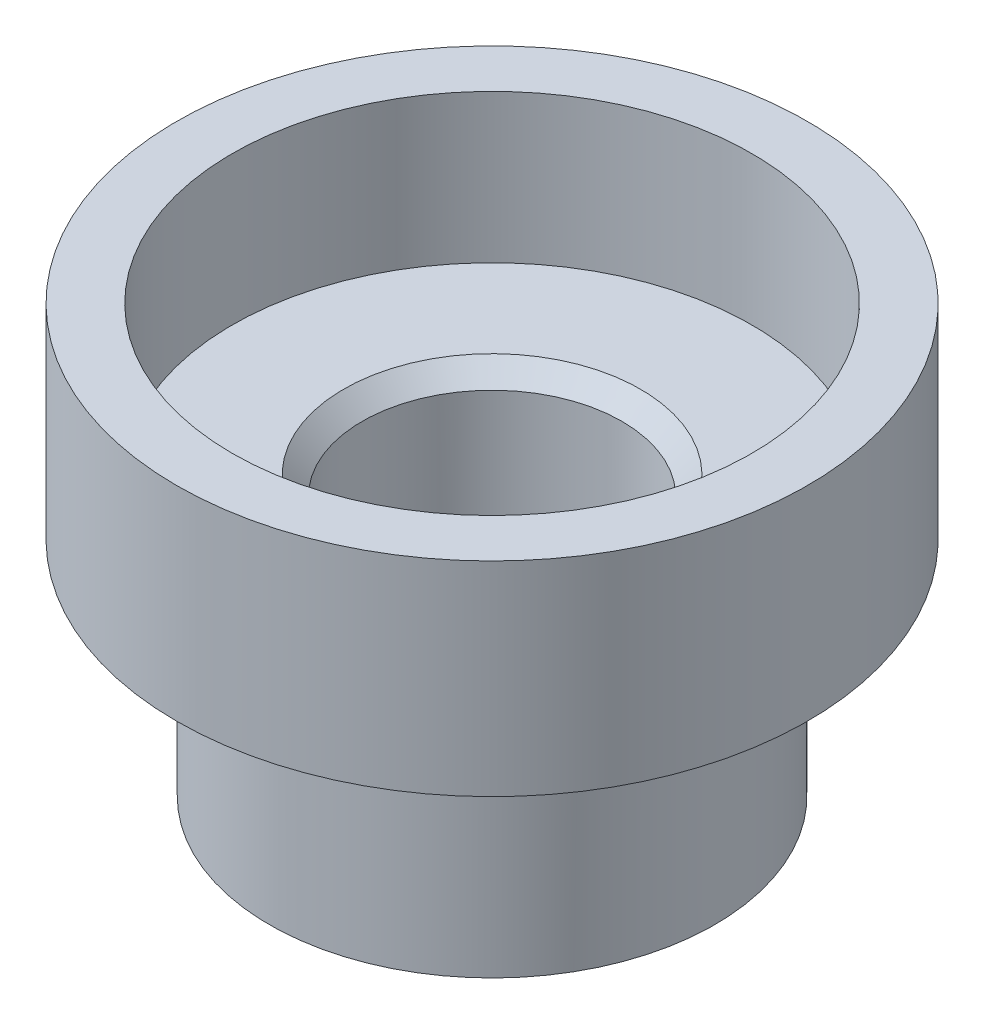
ISO-10303-21;
HEADER;
FILE_DESCRIPTION(('STEP AP214'),'2;1');
FILE_NAME('part.step','',(''),(''),'','','');
FILE_SCHEMA(('AUTOMOTIVE_DESIGN { 1 0 10303 214 1 1 1 1 }'));
ENDSEC;
DATA;
#1=APPLICATION_CONTEXT('core data for automotive mechanical design processes');
#2=APPLICATION_PROTOCOL_DEFINITION('international standard','automotive_design',2000,#1);
#3=PRODUCT_CONTEXT('',#1,'mechanical');
#4=PRODUCT('Part','Part','',(#3));
#5=PRODUCT_RELATED_PRODUCT_CATEGORY('part','',(#4));
#6=PRODUCT_DEFINITION_FORMATION('','',#4);
#7=PRODUCT_DEFINITION_CONTEXT('part definition',#1,'design');
#8=PRODUCT_DEFINITION('design','',#6,#7);
#9=PRODUCT_DEFINITION_SHAPE('','',#8);
#10=(LENGTH_UNIT() NAMED_UNIT(*) SI_UNIT(.MILLI.,.METRE.));
#11=(NAMED_UNIT(*) PLANE_ANGLE_UNIT() SI_UNIT($,.RADIAN.));
#12=(NAMED_UNIT(*) SI_UNIT($,.STERADIAN.) SOLID_ANGLE_UNIT());
#13=UNCERTAINTY_MEASURE_WITH_UNIT(LENGTH_MEASURE(1.E-05),#10,'distance_accuracy_value','');
#14=(GEOMETRIC_REPRESENTATION_CONTEXT(3) GLOBAL_UNCERTAINTY_ASSIGNED_CONTEXT((#13)) GLOBAL_UNIT_ASSIGNED_CONTEXT((#10,
#11,#12)) REPRESENTATION_CONTEXT('',''));
#15=CARTESIAN_POINT('',(0.,0.,0.));
#16=DIRECTION('',(0.,0.,1.));
#17=DIRECTION('',(1.,0.,0.));
#18=AXIS2_PLACEMENT_3D('',#15,#16,#17);
#19=CARTESIAN_POINT('',(0.,0.,0.));
#20=DIRECTION('',(0.,1.,0.));
#21=DIRECTION('',(0.,0.,1.));
#22=AXIS2_PLACEMENT_3D('',#19,#20,#21);
#23=CYLINDRICAL_SURFACE('',#22,1.4);
#24=CARTESIAN_POINT('',(0.,-4.6,0.));
#25=DIRECTION('',(0.,1.,0.));
#26=DIRECTION('',(0.,0.,1.));
#27=AXIS2_PLACEMENT_3D('',#24,#25,#26);
#28=CIRCLE('',#27,1.4);
#29=CARTESIAN_POINT('',(0.,-4.6,1.4));
#30=VERTEX_POINT('',#29);
#31=EDGE_CURVE('E90',#30,#30,#28,.F.);
#32=ORIENTED_EDGE('',*,*,#31,.T.);
#33=EDGE_LOOP('',(#32));
#34=FACE_BOUND('',#33,.T.);
#35=CARTESIAN_POINT('',(0.,-1.79999999994607,0.));
#36=DIRECTION('',(0.,1.,0.));
#37=DIRECTION('',(0.,0.,-1.));
#38=AXIS2_PLACEMENT_3D('',#35,#36,#37);
#39=CIRCLE('',#38,1.39999999998963);
#40=CARTESIAN_POINT('',(0.,-1.79999999994607,-1.39999999998963));
#41=VERTEX_POINT('',#40);
#42=EDGE_CURVE('E88',#41,#41,#39,.T.);
#43=ORIENTED_EDGE('',*,*,#42,.T.);
#44=EDGE_LOOP('',(#43));
#45=FACE_BOUND('',#44,.T.);
#46=ADVANCED_FACE('F16',(#34,#45),#23,.F.);
#47=CARTESIAN_POINT('',(0.,-1.59999999999627,0.));
#48=DIRECTION('',(0.,1.,0.));
#49=DIRECTION('',(0.,0.,1.));
#50=AXIS2_PLACEMENT_3D('',#47,#48,#49);
#51=CONICAL_SURFACE('',#50,1.59999999993943,0.785398163397448);
#52=CARTESIAN_POINT('',(0.,-1.59999999993943,0.));
#53=DIRECTION('',(0.,1.,0.));
#54=DIRECTION('',(0.,0.,1.));
#55=AXIS2_PLACEMENT_3D('',#52,#53,#54);
#56=CIRCLE('',#55,1.59999999999627);
#57=CARTESIAN_POINT('',(0.,-1.59999999993943,1.59999999999627));
#58=VERTEX_POINT('',#57);
#59=EDGE_CURVE('E101',#58,#58,#56,.F.);
#60=ORIENTED_EDGE('',*,*,#59,.F.);
#61=EDGE_LOOP('',(#60));
#62=FACE_BOUND('',#61,.T.);
#63=ORIENTED_EDGE('',*,*,#42,.F.);
#64=EDGE_LOOP('',(#63));
#65=FACE_BOUND('',#64,.T.);
#66=ADVANCED_FACE('F112',(#62,#65),#51,.F.);
#67=CARTESIAN_POINT('',(0.,-4.6,0.));
#68=DIRECTION('',(0.,1.,0.));
#69=DIRECTION('',(0.,0.,1.));
#70=AXIS2_PLACEMENT_3D('',#67,#68,#69);
#71=PLANE('',#70);
#72=ORIENTED_EDGE('',*,*,#31,.F.);
#73=EDGE_LOOP('',(#72));
#74=FACE_BOUND('',#73,.T.);
#75=CARTESIAN_POINT('',(0.,-4.6,0.));
#76=DIRECTION('',(0.,-1.,0.));
#77=DIRECTION('',(0.,0.,-1.));
#78=AXIS2_PLACEMENT_3D('',#75,#76,#77);
#79=CIRCLE('',#78,2.4);
#80=CARTESIAN_POINT('',(0.,-4.6,-2.4));
#81=VERTEX_POINT('',#80);
#82=EDGE_CURVE('E98',#81,#81,#79,.F.);
#83=ORIENTED_EDGE('',*,*,#82,.F.);
#84=EDGE_LOOP('',(#83));
#85=FACE_BOUND('',#84,.T.);
#86=ADVANCED_FACE('F108',(#74,#85),#71,.F.);
#87=CARTESIAN_POINT('',(0.,-1.6,0.));
#88=DIRECTION('',(0.,1.,0.));
#89=DIRECTION('',(0.,0.,1.));
#90=AXIS2_PLACEMENT_3D('',#87,#88,#89);
#91=PLANE('',#90);
#92=ORIENTED_EDGE('',*,*,#59,.T.);
#93=EDGE_LOOP('',(#92));
#94=FACE_BOUND('',#93,.T.);
#95=CARTESIAN_POINT('',(0.,-1.6,0.));
#96=DIRECTION('',(0.,1.,0.));
#97=DIRECTION('',(0.,0.,1.));
#98=AXIS2_PLACEMENT_3D('',#95,#96,#97);
#99=CIRCLE('',#98,2.8);
#100=CARTESIAN_POINT('',(0.,-1.6,2.8));
#101=VERTEX_POINT('',#100);
#102=EDGE_CURVE('E87',#101,#101,#99,.T.);
#103=ORIENTED_EDGE('',*,*,#102,.T.);
#104=EDGE_LOOP('',(#103));
#105=FACE_BOUND('',#104,.T.);
#106=ADVANCED_FACE('F111',(#94,#105),#91,.T.);
#107=CARTESIAN_POINT('',(0.,-2.08,0.));
#108=DIRECTION('',(0.,-1.,0.));
#109=DIRECTION('',(0.,0.,-1.));
#110=AXIS2_PLACEMENT_3D('',#107,#108,#109);
#111=CYLINDRICAL_SURFACE('',#110,2.4);
#112=ORIENTED_EDGE('',*,*,#82,.T.);
#113=EDGE_LOOP('',(#112));
#114=FACE_BOUND('',#113,.T.);
#115=CARTESIAN_POINT('',(0.,-2.4,0.));
#116=DIRECTION('',(0.,-1.,0.));
#117=DIRECTION('',(0.999978425521982,0.,0.00656875106682888));
#118=AXIS2_PLACEMENT_3D('',#115,#116,#117);
#119=CIRCLE('',#118,2.4);
#120=CARTESIAN_POINT('',(2.39994822125276,-2.4,0.0157650025603893));
#121=VERTEX_POINT('',#120);
#122=EDGE_CURVE('E79',#121,#121,#119,.T.);
#123=ORIENTED_EDGE('',*,*,#122,.T.);
#124=EDGE_LOOP('',(#123));
#125=FACE_BOUND('',#124,.T.);
#126=ADVANCED_FACE('F116',(#114,#125),#111,.T.);
#127=CARTESIAN_POINT('',(0.,0.,0.));
#128=DIRECTION('',(0.,1.,0.));
#129=DIRECTION('',(0.,0.,1.));
#130=AXIS2_PLACEMENT_3D('',#127,#128,#129);
#131=CYLINDRICAL_SURFACE('',#130,2.8);
#132=ORIENTED_EDGE('',*,*,#102,.F.);
#133=EDGE_LOOP('',(#132));
#134=FACE_BOUND('',#133,.T.);
#135=CARTESIAN_POINT('',(0.,0.,0.));
#136=DIRECTION('',(0.,1.,0.));
#137=DIRECTION('',(0.,0.,1.));
#138=AXIS2_PLACEMENT_3D('',#135,#136,#137);
#139=CIRCLE('',#138,2.8);
#140=CARTESIAN_POINT('',(0.,0.,2.8));
#141=VERTEX_POINT('',#140);
#142=EDGE_CURVE('E41',#141,#141,#139,.F.);
#143=ORIENTED_EDGE('',*,*,#142,.F.);
#144=EDGE_LOOP('',(#143));
#145=FACE_BOUND('',#144,.T.);
#146=ADVANCED_FACE('F72',(#134,#145),#131,.F.);
#147=CARTESIAN_POINT('',(0.,-2.4,0.));
#148=DIRECTION('',(0.,-1.,0.));
#149=DIRECTION('',(0.999978425521982,0.,0.00656875106682888));
#150=AXIS2_PLACEMENT_3D('',#147,#148,#149);
#151=TOROIDAL_SURFACE('',#150,2.6,0.2);
#152=CARTESIAN_POINT('',(0.,-2.2,0.));
#153=DIRECTION('',(0.,-1.,0.));
#154=DIRECTION('',(-1.,0.,0.));
#155=AXIS2_PLACEMENT_3D('',#152,#153,#154);
#156=CIRCLE('',#155,2.6);
#157=CARTESIAN_POINT('',(2.6,-2.2,0.));
#158=VERTEX_POINT('',#157);
#159=CARTESIAN_POINT('',(-2.6,-2.2,0.));
#160=VERTEX_POINT('',#159);
#161=EDGE_CURVE('E33',#158,#160,#156,.F.);
#162=ORIENTED_EDGE('',*,*,#161,.F.);
#163=CARTESIAN_POINT('',(2.6,-2.2,0.));
#164=CARTESIAN_POINT('',(2.60000049920992,-2.19999999999139,0.0056928883836762));
#165=CARTESIAN_POINT('',(2.59998246540807,-2.19999999999483,0.0113858551680357));
#166=CARTESIAN_POINT('',(2.59974849726799,-2.20000000008924,0.0477789546559938));
#167=CARTESIAN_POINT('',(2.59901122190446,-2.20000000049821,0.0784775062482753));
#168=CARTESIAN_POINT('',(2.59620687520372,-2.20000000186266,0.145566160742074));
#169=CARTESIAN_POINT('',(2.59391688959473,-2.20000000290605,0.181946953105996));
#170=CARTESIAN_POINT('',(2.58758655164244,-2.20000000537667,0.257229030238127));
#171=CARTESIAN_POINT('',(2.58343072841022,-2.20000000682634,0.29612063962772));
#172=CARTESIAN_POINT('',(2.57302595143077,-2.20000000995503,0.376312746587248));
#173=CARTESIAN_POINT('',(2.56665392958692,-2.20000001164292,0.417597304666159));
#174=CARTESIAN_POINT('',(2.55145914789221,-2.20000001510365,0.502428173414846));
#175=CARTESIAN_POINT('',(2.54250622952022,-2.20000001687504,0.545951216491432));
#176=CARTESIAN_POINT('',(2.521779717035,-2.20000002037768,0.635069676759465));
#177=CARTESIAN_POINT('',(2.50986940992886,-2.20000002210017,0.680633287592458));
#178=CARTESIAN_POINT('',(2.48284872490839,-2.20000002539739,0.773601891502925));
#179=CARTESIAN_POINT('',(2.46759565669384,-2.20000002695829,0.820965637994777));
#180=CARTESIAN_POINT('',(2.44236676382686,-2.20000002909435,0.892230338547363));
#181=CARTESIAN_POINT('',(2.43337128319695,-2.20000002978309,0.91648290745991));
#182=CARTESIAN_POINT('',(2.4144198621738,-2.20000003109046,0.965329130709146));
#183=CARTESIAN_POINT('',(2.40444518372355,-2.20000003170683,0.98991554023767));
#184=CARTESIAN_POINT('',(2.38348870400012,-2.20000003286105,1.03938316888263));
#185=CARTESIAN_POINT('',(2.37248793469863,-2.20000003339653,1.06425634727739));
#186=CARTESIAN_POINT('',(2.34943302342192,-2.20000003438198,1.11424880131724));
#187=CARTESIAN_POINT('',(2.33735971041643,-2.20000003482955,1.13935923917053));
#188=CARTESIAN_POINT('',(2.31211462640453,-2.20000003563338,1.1897732394156));
#189=CARTESIAN_POINT('',(2.29892352368212,-2.20000003598721,1.21506712239832));
#190=CARTESIAN_POINT('',(2.27139909535386,-2.20000003659909,1.26579115637098));
#191=CARTESIAN_POINT('',(2.25704631935049,-2.20000003685471,1.29121075471471));
#192=CARTESIAN_POINT('',(2.22715644500432,-2.20000003726691,1.34212526192931));
#193=CARTESIAN_POINT('',(2.21159982361408,-2.20000003742109,1.36760871123694));
#194=CARTESIAN_POINT('',(2.17926214015292,-2.20000003762844,1.41858583095655));
#195=CARTESIAN_POINT('',(2.16246153134293,-2.20000003767928,1.44406710352102));
#196=CARTESIAN_POINT('',(2.12759808256162,-2.2000000376792,1.49497058946909));
#197=CARTESIAN_POINT('',(2.10951572440166,-2.20000003762605,1.52037943680667));
#198=CARTESIAN_POINT('',(2.07205367478976,-2.20000003741854,1.57106457652729));
#199=CARTESIAN_POINT('',(2.05265454916798,-2.20000003726206,1.59632650678065));
#200=CARTESIAN_POINT('',(2.01252692909229,-2.20000003684972,1.64664009634932));
#201=CARTESIAN_POINT('',(1.99177914321527,-2.20000003659185,1.67167637179899));
#202=CARTESIAN_POINT('',(1.94892562750246,-2.20000003597982,1.72145673769549));
#203=CARTESIAN_POINT('',(1.92680081096262,-2.2000000356238,1.74618439944195));
#204=CARTESIAN_POINT('',(1.88116852787742,-2.20000003481983,1.79526147586282));
#205=CARTESIAN_POINT('',(1.85764224453558,-2.20000003437019,1.81959339676088));
#206=CARTESIAN_POINT('',(1.80918661295156,-2.2000000333846,1.86778886220142));
#207=CARTESIAN_POINT('',(1.78423878617192,-2.20000003284713,1.8916338308304));
#208=CARTESIAN_POINT('',(1.73292437787924,-2.20000003169282,1.93876130906778));
#209=CARTESIAN_POINT('',(1.70653972752502,-2.20000003107464,1.96202414707447));
#210=CARTESIAN_POINT('',(1.65234115118563,-2.20000002976709,2.00788947734709));
#211=CARTESIAN_POINT('',(1.62450964047459,-2.20000002907659,2.03047119262104));
#212=CARTESIAN_POINT('',(1.56741244314659,-2.20000002763386,2.07487277386282));
#213=CARTESIAN_POINT('',(1.53812973318766,-2.20000002688072,2.09667075194067));
#214=CARTESIAN_POINT('',(1.47813131476025,-2.20000002532345,2.1393999658222));
#215=CARTESIAN_POINT('',(1.44739922428931,-2.20000002451864,2.16030820187491));
#216=CARTESIAN_POINT('',(1.38450975955293,-2.20000002287004,2.20114991927836));
#217=CARTESIAN_POINT('',(1.35233672707269,-2.20000002202582,2.22105929295213));
#218=CARTESIAN_POINT('',(1.28658008951852,-2.20000002031171,2.2597924683124));
#219=CARTESIAN_POINT('',(1.25298163473007,-2.20000001944162,2.27859106358275));
#220=CARTESIAN_POINT('',(1.18439631550461,-2.20000001769037,2.31498942127966));
#221=CARTESIAN_POINT('',(1.14939549656672,-2.20000001680926,2.33256289334157));
#222=CARTESIAN_POINT('',(1.07803551139999,-2.20000001505183,2.36639570998398));
#223=CARTESIAN_POINT('',(1.04166337429884,-2.20000001417583,2.38262770099289));
#224=CARTESIAN_POINT('',(0.967599150323217,-2.20000001244575,2.4136606871214));
#225=CARTESIAN_POINT('',(0.929895165979824,-2.20000001159227,2.42843329249567));
#226=CARTESIAN_POINT('',(0.853214400551235,-2.20000000992567,2.45642957644609));
#227=CARTESIAN_POINT('',(0.81422688617035,-2.20000000911343,2.46962386275218));
#228=CARTESIAN_POINT('',(0.73503536579722,-2.200000007549,2.4943450800528));
#229=CARTESIAN_POINT('',(0.694821881982604,-2.20000000679799,2.50584165684822));
#230=CARTESIAN_POINT('',(0.613244261564996,-2.20000000537702,2.52704914333833));
#231=CARTESIAN_POINT('',(0.571871994162301,-2.20000000470854,2.53672878467978));
#232=CARTESIAN_POINT('',(0.488052487336266,-2.20000000347487,2.55418488816612));
#233=CARTESIAN_POINT('',(0.445598554767478,-2.20000000291146,2.56192922326882));
#234=CARTESIAN_POINT('',(0.359701671925129,-2.20000000191159,2.57539868134831));
#235=CARTESIAN_POINT('',(0.316253557843378,-2.20000000147721,2.58109088110243));
#236=CARTESIAN_POINT('',(0.226355151113188,-2.20000000074271,2.59056473764533));
#237=CARTESIAN_POINT('',(0.179889607501885,-2.20000000045288,2.59420192003577));
#238=CARTESIAN_POINT('',(0.0861005004535176,-2.20000000007049,2.59901120711426));
#239=CARTESIAN_POINT('',(0.0387748811834802,-2.19999999998109,2.60014387835258));
#240=CARTESIAN_POINT('',(-0.036852094016822,-2.20000000001722,2.59988954663493));
#241=CARTESIAN_POINT('',(-0.065158862310671,-2.20000000007083,2.59933192870838));
#242=CARTESIAN_POINT('',(-0.121739777536009,-2.20000000021689,2.59729304454361));
#243=CARTESIAN_POINT('',(-0.150013924539717,-2.20000000030934,2.59581178035418));
#244=CARTESIAN_POINT('',(-0.207901826460404,-2.2000000005072,2.59183050601967));
#245=CARTESIAN_POINT('',(-0.237512352777621,-2.20000000061304,2.58928354236668));
#246=CARTESIAN_POINT('',(-0.296628701811249,-2.20000000080599,2.5831765035699));
#247=CARTESIAN_POINT('',(-0.326134524666092,-2.20000000089311,2.57961642976605));
#248=CARTESIAN_POINT('',(-0.38500683233313,-2.20000000103022,2.57148733767954));
#249=CARTESIAN_POINT('',(-0.414373317257828,-2.2000000010802,2.56691832021165));
#250=CARTESIAN_POINT('',(-0.472932473188287,-2.20000000113336,2.55677671255904));
#251=CARTESIAN_POINT('',(-0.502125144244883,-2.20000000113652,2.55120412266785));
#252=CARTESIAN_POINT('',(-0.560302401608624,-2.20000000109585,2.53906190266789));
#253=CARTESIAN_POINT('',(-0.589286987869451,-2.200000001052,2.53249227233718));
#254=CARTESIAN_POINT('',(-0.647014049385745,-2.20000000092418,2.5183637175657));
#255=CARTESIAN_POINT('',(-0.675756524462602,-2.20000000084021,2.51080479239517));
#256=CARTESIAN_POINT('',(-0.732965618257738,-2.20000000065497,2.49470639418598));
#257=CARTESIAN_POINT('',(-0.761432236630401,-2.20000000055369,2.48616691991898));
#258=CARTESIAN_POINT('',(-0.818056206934506,-2.20000000033957,2.46811791670246));
#259=CARTESIAN_POINT('',(-0.84621355831914,-2.20000000022672,2.45860838603812));
#260=CARTESIAN_POINT('',(-0.904172686957064,-2.20000000009696,2.43791947796357));
#261=CARTESIAN_POINT('',(-0.933949291400278,-2.20000000008744,2.42666948090111));
#262=CARTESIAN_POINT('',(-0.991289437013461,-2.19999999992247,2.40380012017548));
#263=CARTESIAN_POINT('',(-1.01887819891595,-2.19999999977585,2.3922438808916));
#264=CARTESIAN_POINT('',(-1.07573695154257,-2.20000000268177,2.36727850174959));
#265=CARTESIAN_POINT('',(-1.1049744447917,-2.20000000597945,2.3537952567429));
#266=CARTESIAN_POINT('',(-1.16293250054748,-2.20000002613954,2.32576297065909));
#267=CARTESIAN_POINT('',(-1.19165308245104,-2.20000004300145,2.31121396967839));
#268=CARTESIAN_POINT('',(-1.24853935838284,-2.20000010827893,2.28107075378478));
#269=CARTESIAN_POINT('',(-1.27670506565022,-2.20000015669375,2.26547656384891));
#270=CARTESIAN_POINT('',(-1.33244372839289,-2.20000030254824,2.23326178019695));
#271=CARTESIAN_POINT('',(-1.36001668989694,-2.20000039998741,2.21664119692686));
#272=CARTESIAN_POINT('',(-1.40251763391783,-2.2000006283131,2.18994990871875));
#273=CARTESIAN_POINT('',(-1.41766183196156,-2.20000072552175,2.18022156893506));
#274=CARTESIAN_POINT('',(-1.4520834083059,-2.20000095590739,2.15759506528938));
#275=CARTESIAN_POINT('',(-1.47129232192555,-2.20000109136861,2.14459233184278));
#276=CARTESIAN_POINT('',(-1.5093395465715,-2.20000129822682,2.11806117818942));
#277=CARTESIAN_POINT('',(-1.52817790202573,-2.20000136963154,2.10453282158787));
#278=CARTESIAN_POINT('',(-1.57270842085949,-2.20000145474458,2.07161626828655));
#279=CARTESIAN_POINT('',(-1.5982253837909,-2.20000143533935,2.05199015661557));
#280=CARTESIAN_POINT('',(-1.64847844464334,-2.20000126329793,2.01177624248936));
#281=CARTESIAN_POINT('',(-1.67321472785214,-2.20000111069361,1.9911886711491));
#282=CARTESIAN_POINT('',(-1.7224663671317,-2.20000073186249,1.94860578048942));
#283=CARTESIAN_POINT('',(-1.74696304726462,-2.20000050399833,1.92658880518035));
#284=CARTESIAN_POINT('',(-1.79500594764417,-2.20000015155488,1.88155874642232));
#285=CARTESIAN_POINT('',(-1.81855247996834,-2.20000002694141,1.85854599526955));
#286=CARTESIAN_POINT('',(-1.85201843433337,-2.19999998808252,1.82486343692104));
#287=CARTESIAN_POINT('',(-1.86221567107484,-2.19999999528252,1.81446588377364));
#288=CARTESIAN_POINT('',(-1.89550890177156,-2.20000001096179,1.77996282880782));
#289=CARTESIAN_POINT('',(-1.91824447461193,-2.20000000907034,1.75550657277056));
#290=CARTESIAN_POINT('',(-1.9677554085096,-2.20000006546473,1.7001580943607));
#291=CARTESIAN_POINT('',(-1.99429276606134,-2.20000013734636,1.66905290464752));
#292=CARTESIAN_POINT('',(-2.04706164575992,-2.20000034052233,1.60415474324957));
#293=CARTESIAN_POINT('',(-2.07322228930638,-2.20000047441013,1.57030399544555));
#294=CARTESIAN_POINT('',(-2.11261951565046,-2.20000065326346,1.51659830038287));
#295=CARTESIAN_POINT('',(-2.12645263221592,-2.20000071136118,1.49717831447742));
#296=CARTESIAN_POINT('',(-2.1520981744878,-2.20000078786894,1.46008403738455));
#297=CARTESIAN_POINT('',(-2.16396707274762,-2.20000080989908,1.44244876771365));
#298=CARTESIAN_POINT('',(-2.19733433179763,-2.20000083609122,1.39151019245463));
#299=CARTESIAN_POINT('',(-2.21828429571028,-2.20000080832775,1.35784547733481));
#300=CARTESIAN_POINT('',(-2.25860515203814,-2.20000070694899,1.28958961539813));
#301=CARTESIAN_POINT('',(-2.27797622590722,-2.20000063333897,1.25499857564786));
#302=CARTESIAN_POINT('',(-2.31159700194631,-2.20000047298059,1.19156209789266));
#303=CARTESIAN_POINT('',(-2.32612367002117,-2.20000039132649,1.16286309531945));
#304=CARTESIAN_POINT('',(-2.35409018104195,-2.20000023345619,1.10494453241244));
#305=CARTESIAN_POINT('',(-2.3675301628153,-2.20000015723929,1.07572503915677));
#306=CARTESIAN_POINT('',(-2.3936014014656,-2.20000004030497,1.01610689776663));
#307=CARTESIAN_POINT('',(-2.40620620974152,-2.20000000046445,0.985696678839684));
#308=CARTESIAN_POINT('',(-2.4288367994848,-2.19999999959132,0.928055645714877));
#309=CARTESIAN_POINT('',(-2.43899119016448,-2.20000002977847,0.90087515513247));
#310=CARTESIAN_POINT('',(-2.45865381059271,-2.20000008084605,0.845543980574874));
#311=CARTESIAN_POINT('',(-2.46814063198186,-2.20000010148522,0.817385683186435));
#312=CARTESIAN_POINT('',(-2.48617116017715,-2.20000010319827,0.760773499109948));
#313=CARTESIAN_POINT('',(-2.49471500939209,-2.20000008427812,0.732319657767393));
#314=CARTESIAN_POINT('',(-2.51085741777194,-2.20000003993552,0.675148410552356));
#315=CARTESIAN_POINT('',(-2.51845608276173,-2.20000001451379,0.646431034573074));
#316=CARTESIAN_POINT('',(-2.53268336324213,-2.19999998649454,0.588759242913079));
#317=CARTESIAN_POINT('',(-2.53931204940885,-2.19999998389536,0.559804844665148));
#318=CARTESIAN_POINT('',(-2.54864202887309,-2.20000020460551,0.515884816666666));
#319=CARTESIAN_POINT('',(-2.55168088833789,-2.20000031825361,0.500990339957168));
#320=CARTESIAN_POINT('',(-2.55986759466819,-2.2000004949118,0.458528551453289));
#321=CARTESIAN_POINT('',(-2.56462800174802,-2.20000043400824,0.430886535562688));
#322=CARTESIAN_POINT('',(-2.57711373919438,-2.20000027399825,0.350722257943054));
#323=CARTESIAN_POINT('',(-2.58369242412868,-2.20000018932043,0.298016809680987));
#324=CARTESIAN_POINT('',(-2.59146885405815,-2.20000008779285,0.214941669001089));
#325=CARTESIAN_POINT('',(-2.59376450136401,-2.20000005742487,0.184669803898485));
#326=CARTESIAN_POINT('',(-2.59853036395245,-2.19999999749993,0.102974880224405));
#327=CARTESIAN_POINT('',(-2.60001028262786,-2.19999998321459,0.0514930136698055));
#328=CARTESIAN_POINT('',(-2.6,-2.2,0.));
#329=B_SPLINE_CURVE_WITH_KNOTS('',3,(#163,#164,#165,#166,#167,#168,#169,#170,#171,#172,#173,
#174,#175,#176,#177,#178,#179,#180,#181,#182,#183,#184,#185,#186,#187,#188,#189,#190,#191,#192,
#193,#194,#195,#196,#197,#198,#199,#200,#201,#202,#203,#204,#205,#206,#207,#208,#209,#210,#211,
#212,#213,#214,#215,#216,#217,#218,#219,#220,#221,#222,#223,#224,#225,#226,#227,#228,#229,#230,
#231,#232,#233,#234,#235,#236,#237,#238,#239,#240,#241,#242,#243,#244,#245,#246,#247,#248,#249,
#250,#251,#252,#253,#254,#255,#256,#257,#258,#259,#260,#261,#262,#263,#264,#265,#266,#267,#268,
#269,#270,#271,#272,#273,#274,#275,#276,#277,#278,#279,#280,#281,#282,#283,#284,#285,#286,#287,
#288,#289,#290,#291,#292,#293,#294,#295,#296,#297,#298,#299,#300,#301,#302,#303,#304,#305,#306,
#307,#308,#309,#310,#311,#312,#313,#314,#315,#316,#317,#318,#319,#320,#321,#322,#323,#324,#325,
#326,#327,#328),.UNSPECIFIED.,.F.,.F.,(4,2,2,2,2,2,2,2,2,2,2,2,2,2,2,2,2,2,2,2,2,2,2,2,2,2,2,2,
2,2,2,2,2,2,2,2,2,2,2,2,2,2,2,2,2,2,2,2,2,2,2,2,2,2,2,2,2,2,2,2,2,2,2,2,2,2,2,2,2,2,2,2,2,2,2,2,
2,2,2,2,2,2,4),(0.,0.0170788514401823,0.109180065598782,0.218506321988646,0.335805478571176,
0.461077273852262,0.594321408883524,0.735537547267529,0.884725315162214,0.962317069628469,
1.04190225716281,1.12348085558846,1.20705284126717,1.29261818909928,1.38017687252374,
1.46972886351815,1.56127413259881,1.65481264882075,1.75034437977776,1.84786929160242,
1.94738734896614,2.04889851507921,2.15240275169077,2.25790001908891,2.36539027610067,
2.47487348009205,2.58634958696807,2.6998185511728,2.81528032568938,2.93273486204001,
3.05218211028607,3.17362201902808,3.29705453540575,3.42247960509801,3.54989717232304,
3.67930717983832,3.81070956894064,3.95046611466727,4.0924079078375,4.17733141726956,
4.26225473832811,4.35139686684637,4.44053887746382,4.52968081609472,4.6188227286533,
4.70796466105381,4.79710665921048,4.88624876903757,4.97539103644931,5.07086186851326,
5.16057882044586,5.2571469197353,5.35371138775519,5.45027354897983,5.54683472761464,
5.60083060573766,5.67040900119865,5.73997900310269,5.83652850947084,5.93305492561267,
6.03183737289254,6.13058710635135,6.17427690522248,6.27442605410344,6.39704337467051,
6.52533035350631,6.59685102649464,6.66061714337516,6.77952501425693,6.89841920033185,
6.994895577451,7.09135960988557,7.19009197576175,7.27712320383641,7.36624713896513,
7.455357596019,7.54445806707406,7.63355204271495,7.67915345528117,7.76328372959619,
7.92251407127643,8.01357470782754,8.16800593990304),.UNSPECIFIED.);
#330=EDGE_CURVE('E36',#160,#158,#329,.F.);
#331=ORIENTED_EDGE('',*,*,#330,.F.);
#332=EDGE_LOOP('',(#162,#331));
#333=FACE_BOUND('',#332,.T.);
#334=ORIENTED_EDGE('',*,*,#122,.F.);
#335=EDGE_LOOP('',(#334));
#336=FACE_BOUND('',#335,.T.);
#337=ADVANCED_FACE('F37',(#333,#336),#151,.F.);
#338=CARTESIAN_POINT('',(0.,0.,0.));
#339=DIRECTION('',(0.,1.,0.));
#340=DIRECTION('',(0.,0.,1.));
#341=AXIS2_PLACEMENT_3D('',#338,#339,#340);
#342=PLANE('',#341);
#343=ORIENTED_EDGE('',*,*,#142,.T.);
#344=EDGE_LOOP('',(#343));
#345=FACE_BOUND('',#344,.T.);
#346=CARTESIAN_POINT('',(0.,0.,0.));
#347=DIRECTION('',(0.,1.,0.));
#348=DIRECTION('',(0.,0.,1.));
#349=AXIS2_PLACEMENT_3D('',#346,#347,#348);
#350=CIRCLE('',#349,3.4);
#351=CARTESIAN_POINT('',(0.,0.,3.4));
#352=VERTEX_POINT('',#351);
#353=EDGE_CURVE('E26',#352,#352,#350,.F.);
#354=ORIENTED_EDGE('',*,*,#353,.F.);
#355=EDGE_LOOP('',(#354));
#356=FACE_BOUND('',#355,.T.);
#357=ADVANCED_FACE('F65',(#345,#356),#342,.T.);
#358=CARTESIAN_POINT('',(0.,-2.2,0.));
#359=DIRECTION('',(0.,-1.,0.));
#360=DIRECTION('',(0.,0.,-1.));
#361=AXIS2_PLACEMENT_3D('',#358,#359,#360);
#362=PLANE('',#361);
#363=ORIENTED_EDGE('',*,*,#330,.T.);
#364=ORIENTED_EDGE('',*,*,#161,.T.);
#365=EDGE_LOOP('',(#363,#364));
#366=FACE_BOUND('',#365,.T.);
#367=CARTESIAN_POINT('',(0.,-2.2,0.));
#368=DIRECTION('',(0.,1.,0.));
#369=DIRECTION('',(0.,0.,1.));
#370=AXIS2_PLACEMENT_3D('',#367,#368,#369);
#371=CIRCLE('',#370,3.4);
#372=CARTESIAN_POINT('',(0.,-2.2,3.4));
#373=VERTEX_POINT('',#372);
#374=EDGE_CURVE('E11',#373,#373,#371,.T.);
#375=ORIENTED_EDGE('',*,*,#374,.F.);
#376=EDGE_LOOP('',(#375));
#377=FACE_BOUND('',#376,.T.);
#378=ADVANCED_FACE('F44',(#366,#377),#362,.T.);
#379=CARTESIAN_POINT('',(0.,0.,0.));
#380=DIRECTION('',(0.,1.,0.));
#381=DIRECTION('',(0.,0.,1.));
#382=AXIS2_PLACEMENT_3D('',#379,#380,#381);
#383=CYLINDRICAL_SURFACE('',#382,3.4);
#384=ORIENTED_EDGE('',*,*,#353,.T.);
#385=EDGE_LOOP('',(#384));
#386=FACE_BOUND('',#385,.T.);
#387=ORIENTED_EDGE('',*,*,#374,.T.);
#388=EDGE_LOOP('',(#387));
#389=FACE_BOUND('',#388,.T.);
#390=ADVANCED_FACE('F64',(#386,#389),#383,.T.);
#391=CLOSED_SHELL('',(#46,#66,#86,#106,#126,#146,#337,#357,#378,#390));
#392=MANIFOLD_SOLID_BREP('B1',#391);
#393=ADVANCED_BREP_SHAPE_REPRESENTATION('',(#18,#392),#14);
#394=SHAPE_DEFINITION_REPRESENTATION(#9,#393);
ENDSEC;
END-ISO-10303-21;
